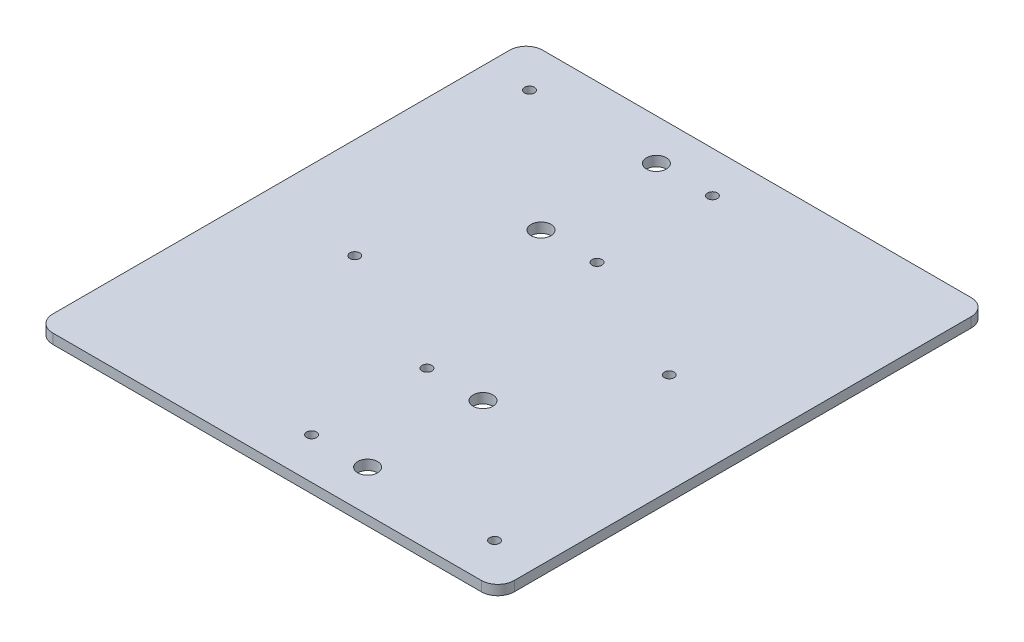
ISO-10303-21;
HEADER;
FILE_DESCRIPTION(('STEP AP214'),'2;1');
FILE_NAME('part.step','',(''),(''),'','','');
FILE_SCHEMA(('AUTOMOTIVE_DESIGN { 1 0 10303 214 1 1 1 1 }'));
ENDSEC;
DATA;
#1=APPLICATION_CONTEXT('core data for automotive mechanical design processes');
#2=APPLICATION_PROTOCOL_DEFINITION('international standard','automotive_design',2000,#1);
#3=PRODUCT_CONTEXT('',#1,'mechanical');
#4=PRODUCT('Part','Part','',(#3));
#5=PRODUCT_RELATED_PRODUCT_CATEGORY('part','',(#4));
#6=PRODUCT_DEFINITION_FORMATION('','',#4);
#7=PRODUCT_DEFINITION_CONTEXT('part definition',#1,'design');
#8=PRODUCT_DEFINITION('design','',#6,#7);
#9=PRODUCT_DEFINITION_SHAPE('','',#8);
#10=(LENGTH_UNIT() NAMED_UNIT(*) SI_UNIT(.MILLI.,.METRE.));
#11=(NAMED_UNIT(*) PLANE_ANGLE_UNIT() SI_UNIT($,.RADIAN.));
#12=(NAMED_UNIT(*) SI_UNIT($,.STERADIAN.) SOLID_ANGLE_UNIT());
#13=UNCERTAINTY_MEASURE_WITH_UNIT(LENGTH_MEASURE(1.E-05),#10,'distance_accuracy_value','');
#14=(GEOMETRIC_REPRESENTATION_CONTEXT(3) GLOBAL_UNCERTAINTY_ASSIGNED_CONTEXT((#13)) GLOBAL_UNIT_ASSIGNED_CONTEXT((#10,
#11,#12)) REPRESENTATION_CONTEXT('',''));
#15=CARTESIAN_POINT('',(0.,0.,0.));
#16=DIRECTION('',(0.,0.,1.));
#17=DIRECTION('',(1.,0.,0.));
#18=AXIS2_PLACEMENT_3D('',#15,#16,#17);
#19=CARTESIAN_POINT('',(-70.,3.,74.3));
#20=DIRECTION('',(1.,0.,0.));
#21=DIRECTION('',(0.,0.,-1.));
#22=AXIS2_PLACEMENT_3D('',#19,#20,#21);
#23=PLANE('',#22);
#24=DIRECTION('',(0.,0.,1.));
#25=VECTOR('',#24,1.);
#26=CARTESIAN_POINT('',(-70.,3.,74.3));
#27=LINE('',#26,#25);
#28=CARTESIAN_POINT('',(-70.,3.,-69.3));
#29=VERTEX_POINT('',#28);
#30=CARTESIAN_POINT('',(-70.,3.,69.3));
#31=VERTEX_POINT('',#30);
#32=EDGE_CURVE('E122',#29,#31,#27,.T.);
#33=ORIENTED_EDGE('',*,*,#32,.F.);
#34=DIRECTION('',(0.,-1.,0.));
#35=VECTOR('',#34,1.);
#36=CARTESIAN_POINT('',(-70.,3.,-69.3));
#37=LINE('',#36,#35);
#38=CARTESIAN_POINT('',(-70.,0.,-69.3));
#39=VERTEX_POINT('',#38);
#40=EDGE_CURVE('E107',#29,#39,#37,.T.);
#41=ORIENTED_EDGE('',*,*,#40,.T.);
#42=DIRECTION('',(0.,0.,1.));
#43=VECTOR('',#42,1.);
#44=CARTESIAN_POINT('',(-70.,0.,74.3));
#45=LINE('',#44,#43);
#46=CARTESIAN_POINT('',(-70.,0.,69.3));
#47=VERTEX_POINT('',#46);
#48=EDGE_CURVE('E119',#39,#47,#45,.T.);
#49=ORIENTED_EDGE('',*,*,#48,.T.);
#50=DIRECTION('',(0.,-1.,0.));
#51=VECTOR('',#50,1.);
#52=CARTESIAN_POINT('',(-70.,3.,69.3));
#53=LINE('',#52,#51);
#54=EDGE_CURVE('E124',#47,#31,#53,.F.);
#55=ORIENTED_EDGE('',*,*,#54,.T.);
#56=EDGE_LOOP('',(#33,#41,#49,#55));
#57=FACE_BOUND('',#56,.T.);
#58=ADVANCED_FACE('F37',(#57),#23,.F.);
#59=CARTESIAN_POINT('',(70.,3.,74.3));
#60=DIRECTION('',(0.,0.,-1.));
#61=DIRECTION('',(-1.,0.,0.));
#62=AXIS2_PLACEMENT_3D('',#59,#60,#61);
#63=PLANE('',#62);
#64=DIRECTION('',(1.,0.,0.));
#65=VECTOR('',#64,1.);
#66=CARTESIAN_POINT('',(70.,0.,74.3));
#67=LINE('',#66,#65);
#68=CARTESIAN_POINT('',(-65.,0.,74.3));
#69=VERTEX_POINT('',#68);
#70=CARTESIAN_POINT('',(65.,0.,74.3));
#71=VERTEX_POINT('',#70);
#72=EDGE_CURVE('E128',#69,#71,#67,.T.);
#73=ORIENTED_EDGE('',*,*,#72,.T.);
#74=DIRECTION('',(0.,-1.,0.));
#75=VECTOR('',#74,1.);
#76=CARTESIAN_POINT('',(65.,3.,74.3));
#77=LINE('',#76,#75);
#78=CARTESIAN_POINT('',(65.,3.,74.3));
#79=VERTEX_POINT('',#78);
#80=EDGE_CURVE('E11',#71,#79,#77,.F.);
#81=ORIENTED_EDGE('',*,*,#80,.T.);
#82=DIRECTION('',(1.,0.,0.));
#83=VECTOR('',#82,1.);
#84=CARTESIAN_POINT('',(70.,3.,74.3));
#85=LINE('',#84,#83);
#86=CARTESIAN_POINT('',(-65.,3.,74.3));
#87=VERTEX_POINT('',#86);
#88=EDGE_CURVE('E168',#87,#79,#85,.T.);
#89=ORIENTED_EDGE('',*,*,#88,.F.);
#90=DIRECTION('',(0.,-1.,0.));
#91=VECTOR('',#90,1.);
#92=CARTESIAN_POINT('',(-65.,3.,74.3));
#93=LINE('',#92,#91);
#94=EDGE_CURVE('E45',#87,#69,#93,.T.);
#95=ORIENTED_EDGE('',*,*,#94,.T.);
#96=EDGE_LOOP('',(#73,#81,#89,#95));
#97=FACE_BOUND('',#96,.T.);
#98=ADVANCED_FACE('F166',(#97),#63,.F.);
#99=CARTESIAN_POINT('',(70.,3.,74.3));
#100=DIRECTION('',(-1.,0.,0.));
#101=DIRECTION('',(0.,0.,1.));
#102=AXIS2_PLACEMENT_3D('',#99,#100,#101);
#103=PLANE('',#102);
#104=DIRECTION('',(0.,0.,-1.));
#105=VECTOR('',#104,1.);
#106=CARTESIAN_POINT('',(70.,0.,74.3));
#107=LINE('',#106,#105);
#108=CARTESIAN_POINT('',(70.,0.,69.3));
#109=VERTEX_POINT('',#108);
#110=CARTESIAN_POINT('',(70.,0.,-69.3));
#111=VERTEX_POINT('',#110);
#112=EDGE_CURVE('E132',#109,#111,#107,.T.);
#113=ORIENTED_EDGE('',*,*,#112,.T.);
#114=DIRECTION('',(0.,-1.,0.));
#115=VECTOR('',#114,1.);
#116=CARTESIAN_POINT('',(70.,3.,-69.3));
#117=LINE('',#116,#115);
#118=CARTESIAN_POINT('',(70.,3.,-69.3));
#119=VERTEX_POINT('',#118);
#120=EDGE_CURVE('E52',#111,#119,#117,.F.);
#121=ORIENTED_EDGE('',*,*,#120,.T.);
#122=DIRECTION('',(0.,0.,-1.));
#123=VECTOR('',#122,1.);
#124=CARTESIAN_POINT('',(70.,3.,74.3));
#125=LINE('',#124,#123);
#126=CARTESIAN_POINT('',(70.,3.,69.3));
#127=VERTEX_POINT('',#126);
#128=EDGE_CURVE('E176',#127,#119,#125,.T.);
#129=ORIENTED_EDGE('',*,*,#128,.F.);
#130=DIRECTION('',(0.,-1.,0.));
#131=VECTOR('',#130,1.);
#132=CARTESIAN_POINT('',(70.,3.,69.3));
#133=LINE('',#132,#131);
#134=EDGE_CURVE('E159',#127,#109,#133,.T.);
#135=ORIENTED_EDGE('',*,*,#134,.T.);
#136=EDGE_LOOP('',(#113,#121,#129,#135));
#137=FACE_BOUND('',#136,.T.);
#138=ADVANCED_FACE('F175',(#137),#103,.F.);
#139=CARTESIAN_POINT('',(70.,3.,-74.3));
#140=DIRECTION('',(0.,0.,1.));
#141=DIRECTION('',(1.,0.,0.));
#142=AXIS2_PLACEMENT_3D('',#139,#140,#141);
#143=PLANE('',#142);
#144=DIRECTION('',(-1.,0.,0.));
#145=VECTOR('',#144,1.);
#146=CARTESIAN_POINT('',(70.,0.,-74.3));
#147=LINE('',#146,#145);
#148=CARTESIAN_POINT('',(65.,0.,-74.3));
#149=VERTEX_POINT('',#148);
#150=CARTESIAN_POINT('',(-65.,0.,-74.3));
#151=VERTEX_POINT('',#150);
#152=EDGE_CURVE('E142',#149,#151,#147,.T.);
#153=ORIENTED_EDGE('',*,*,#152,.T.);
#154=DIRECTION('',(0.,-1.,0.));
#155=VECTOR('',#154,1.);
#156=CARTESIAN_POINT('',(-65.,3.,-74.3));
#157=LINE('',#156,#155);
#158=CARTESIAN_POINT('',(-65.,3.,-74.3));
#159=VERTEX_POINT('',#158);
#160=EDGE_CURVE('E108',#151,#159,#157,.F.);
#161=ORIENTED_EDGE('',*,*,#160,.T.);
#162=DIRECTION('',(-1.,0.,0.));
#163=VECTOR('',#162,1.);
#164=CARTESIAN_POINT('',(70.,3.,-74.3));
#165=LINE('',#164,#163);
#166=CARTESIAN_POINT('',(65.,3.,-74.3));
#167=VERTEX_POINT('',#166);
#168=EDGE_CURVE('E138',#167,#159,#165,.T.);
#169=ORIENTED_EDGE('',*,*,#168,.F.);
#170=DIRECTION('',(0.,-1.,0.));
#171=VECTOR('',#170,1.);
#172=CARTESIAN_POINT('',(65.,3.,-74.3));
#173=LINE('',#172,#171);
#174=EDGE_CURVE('E113',#167,#149,#173,.T.);
#175=ORIENTED_EDGE('',*,*,#174,.T.);
#176=EDGE_LOOP('',(#153,#161,#169,#175));
#177=FACE_BOUND('',#176,.T.);
#178=ADVANCED_FACE('F264',(#177),#143,.F.);
#179=CARTESIAN_POINT('',(0.,3.,0.));
#180=DIRECTION('',(0.,1.,0.));
#181=DIRECTION('',(0.,0.,1.));
#182=AXIS2_PLACEMENT_3D('',#179,#180,#181);
#183=PLANE('',#182);
#184=CARTESIAN_POINT('',(39.5,3.,-8.20000000000001));
#185=DIRECTION('',(0.,1.,0.));
#186=DIRECTION('',(0.,0.,-1.));
#187=AXIS2_PLACEMENT_3D('',#184,#185,#186);
#188=CIRCLE('',#187,1.5);
#189=CARTESIAN_POINT('',(39.5,3.,-9.70000000000002));
#190=VERTEX_POINT('',#189);
#191=EDGE_CURVE('E221',#190,#190,#188,.T.);
#192=ORIENTED_EDGE('',*,*,#191,.F.);
#193=EDGE_LOOP('',(#192));
#194=FACE_BOUND('',#193,.T.);
#195=CARTESIAN_POINT('',(18.,3.,61.8));
#196=DIRECTION('',(0.,1.,0.));
#197=DIRECTION('',(0.,0.,-1.));
#198=AXIS2_PLACEMENT_3D('',#195,#196,#197);
#199=CIRCLE('',#198,3.);
#200=CARTESIAN_POINT('',(18.,3.,58.8));
#201=VERTEX_POINT('',#200);
#202=EDGE_CURVE('E235',#201,#201,#199,.T.);
#203=ORIENTED_EDGE('',*,*,#202,.F.);
#204=EDGE_LOOP('',(#203));
#205=FACE_BOUND('',#204,.T.);
#206=CARTESIAN_POINT('',(1.00000000000002,3.,61.8));
#207=DIRECTION('',(0.,1.,0.));
#208=DIRECTION('',(0.,0.,-1.));
#209=AXIS2_PLACEMENT_3D('',#206,#207,#208);
#210=CIRCLE('',#209,1.5);
#211=CARTESIAN_POINT('',(1.00000000000002,3.,60.3));
#212=VERTEX_POINT('',#211);
#213=EDGE_CURVE('E228',#212,#212,#210,.T.);
#214=ORIENTED_EDGE('',*,*,#213,.F.);
#215=EDGE_LOOP('',(#214));
#216=FACE_BOUND('',#215,.T.);
#217=CARTESIAN_POINT('',(1.00000000000002,3.,26.8));
#218=DIRECTION('',(0.,1.,0.));
#219=DIRECTION('',(0.,0.,-1.));
#220=AXIS2_PLACEMENT_3D('',#217,#218,#219);
#221=CIRCLE('',#220,1.5);
#222=CARTESIAN_POINT('',(1.00000000000002,3.,25.3));
#223=VERTEX_POINT('',#222);
#224=EDGE_CURVE('E245',#223,#223,#221,.T.);
#225=ORIENTED_EDGE('',*,*,#224,.F.);
#226=EDGE_LOOP('',(#225));
#227=FACE_BOUND('',#226,.T.);
#228=CARTESIAN_POINT('',(56.5,3.,61.8));
#229=DIRECTION('',(0.,1.,0.));
#230=DIRECTION('',(0.,0.,-1.));
#231=AXIS2_PLACEMENT_3D('',#228,#229,#230);
#232=CIRCLE('',#231,1.5);
#233=CARTESIAN_POINT('',(56.5,3.,60.3));
#234=VERTEX_POINT('',#233);
#235=EDGE_CURVE('E227',#234,#234,#232,.T.);
#236=ORIENTED_EDGE('',*,*,#235,.F.);
#237=EDGE_LOOP('',(#236));
#238=FACE_BOUND('',#237,.T.);
#239=CARTESIAN_POINT('',(18.,3.,26.8));
#240=DIRECTION('',(0.,1.,0.));
#241=DIRECTION('',(0.,0.,-1.));
#242=AXIS2_PLACEMENT_3D('',#239,#240,#241);
#243=CIRCLE('',#242,3.);
#244=CARTESIAN_POINT('',(18.,3.,23.8));
#245=VERTEX_POINT('',#244);
#246=EDGE_CURVE('E215',#245,#245,#243,.T.);
#247=ORIENTED_EDGE('',*,*,#246,.F.);
#248=EDGE_LOOP('',(#247));
#249=FACE_BOUND('',#248,.T.);
#250=CARTESIAN_POINT('',(-39.5,3.,8.20000000000001));
#251=DIRECTION('',(0.,1.,0.));
#252=DIRECTION('',(0.,0.,1.));
#253=AXIS2_PLACEMENT_3D('',#250,#251,#252);
#254=CIRCLE('',#253,1.5);
#255=CARTESIAN_POINT('',(-39.5,3.,9.70000000000002));
#256=VERTEX_POINT('',#255);
#257=EDGE_CURVE('E185',#256,#256,#254,.T.);
#258=ORIENTED_EDGE('',*,*,#257,.F.);
#259=EDGE_LOOP('',(#258));
#260=FACE_BOUND('',#259,.T.);
#261=CARTESIAN_POINT('',(-18.,3.,-61.8));
#262=DIRECTION('',(0.,1.,0.));
#263=DIRECTION('',(0.,0.,1.));
#264=AXIS2_PLACEMENT_3D('',#261,#262,#263);
#265=CIRCLE('',#264,3.);
#266=CARTESIAN_POINT('',(-18.,3.,-58.8));
#267=VERTEX_POINT('',#266);
#268=EDGE_CURVE('E200',#267,#267,#265,.T.);
#269=ORIENTED_EDGE('',*,*,#268,.F.);
#270=EDGE_LOOP('',(#269));
#271=FACE_BOUND('',#270,.T.);
#272=CARTESIAN_POINT('',(-1.00000000000002,3.,-61.8));
#273=DIRECTION('',(0.,1.,0.));
#274=DIRECTION('',(0.,0.,1.));
#275=AXIS2_PLACEMENT_3D('',#272,#273,#274);
#276=CIRCLE('',#275,1.5);
#277=CARTESIAN_POINT('',(-1.00000000000002,3.,-60.3));
#278=VERTEX_POINT('',#277);
#279=EDGE_CURVE('E193',#278,#278,#276,.T.);
#280=ORIENTED_EDGE('',*,*,#279,.F.);
#281=EDGE_LOOP('',(#280));
#282=FACE_BOUND('',#281,.T.);
#283=CARTESIAN_POINT('',(-1.00000000000002,3.,-26.8));
#284=DIRECTION('',(0.,1.,0.));
#285=DIRECTION('',(0.,0.,1.));
#286=AXIS2_PLACEMENT_3D('',#283,#284,#285);
#287=CIRCLE('',#286,1.5);
#288=CARTESIAN_POINT('',(-1.00000000000002,3.,-25.3));
#289=VERTEX_POINT('',#288);
#290=EDGE_CURVE('E210',#289,#289,#287,.T.);
#291=ORIENTED_EDGE('',*,*,#290,.F.);
#292=EDGE_LOOP('',(#291));
#293=FACE_BOUND('',#292,.T.);
#294=CARTESIAN_POINT('',(-56.5,3.,-61.8));
#295=DIRECTION('',(0.,1.,0.));
#296=DIRECTION('',(0.,0.,1.));
#297=AXIS2_PLACEMENT_3D('',#294,#295,#296);
#298=CIRCLE('',#297,1.5);
#299=CARTESIAN_POINT('',(-56.5,3.,-60.3));
#300=VERTEX_POINT('',#299);
#301=EDGE_CURVE('E192',#300,#300,#298,.T.);
#302=ORIENTED_EDGE('',*,*,#301,.F.);
#303=EDGE_LOOP('',(#302));
#304=FACE_BOUND('',#303,.T.);
#305=CARTESIAN_POINT('',(-18.,3.,-26.8));
#306=DIRECTION('',(0.,1.,0.));
#307=DIRECTION('',(0.,0.,1.));
#308=AXIS2_PLACEMENT_3D('',#305,#306,#307);
#309=CIRCLE('',#308,3.);
#310=CARTESIAN_POINT('',(-18.,3.,-23.8));
#311=VERTEX_POINT('',#310);
#312=EDGE_CURVE('E135',#311,#311,#309,.T.);
#313=ORIENTED_EDGE('',*,*,#312,.F.);
#314=EDGE_LOOP('',(#313));
#315=FACE_BOUND('',#314,.T.);
#316=ORIENTED_EDGE('',*,*,#168,.T.);
#317=CARTESIAN_POINT('',(-65.,3.,-69.3));
#318=DIRECTION('',(0.,1.,0.));
#319=DIRECTION('',(0.,0.,1.));
#320=AXIS2_PLACEMENT_3D('',#317,#318,#319);
#321=CIRCLE('',#320,5.);
#322=EDGE_CURVE('E157',#159,#29,#321,.T.);
#323=ORIENTED_EDGE('',*,*,#322,.T.);
#324=ORIENTED_EDGE('',*,*,#32,.T.);
#325=CARTESIAN_POINT('',(-65.,3.,69.3));
#326=DIRECTION('',(0.,1.,0.));
#327=DIRECTION('',(0.,0.,1.));
#328=AXIS2_PLACEMENT_3D('',#325,#326,#327);
#329=CIRCLE('',#328,5.);
#330=EDGE_CURVE('E152',#31,#87,#329,.T.);
#331=ORIENTED_EDGE('',*,*,#330,.T.);
#332=ORIENTED_EDGE('',*,*,#88,.T.);
#333=CARTESIAN_POINT('',(65.,3.,69.3));
#334=DIRECTION('',(0.,1.,0.));
#335=DIRECTION('',(0.,0.,1.));
#336=AXIS2_PLACEMENT_3D('',#333,#334,#335);
#337=CIRCLE('',#336,5.);
#338=EDGE_CURVE('E59',#79,#127,#337,.T.);
#339=ORIENTED_EDGE('',*,*,#338,.T.);
#340=ORIENTED_EDGE('',*,*,#128,.T.);
#341=CARTESIAN_POINT('',(65.,3.,-69.3));
#342=DIRECTION('',(0.,1.,0.));
#343=DIRECTION('',(0.,0.,1.));
#344=AXIS2_PLACEMENT_3D('',#341,#342,#343);
#345=CIRCLE('',#344,5.);
#346=EDGE_CURVE('E155',#119,#167,#345,.T.);
#347=ORIENTED_EDGE('',*,*,#346,.T.);
#348=EDGE_LOOP('',(#316,#323,#324,#331,#332,#339,#340,#347));
#349=FACE_BOUND('',#348,.T.);
#350=ADVANCED_FACE('F261',(#194,#205,#216,#227,#238,#249,#260,#271,#282,#293,#304,#315,#349),
#183,.T.);
#351=CARTESIAN_POINT('',(0.,0.,0.));
#352=DIRECTION('',(0.,1.,0.));
#353=DIRECTION('',(0.,0.,1.));
#354=AXIS2_PLACEMENT_3D('',#351,#352,#353);
#355=PLANE('',#354);
#356=CARTESIAN_POINT('',(39.5,0.,-8.20000000000001));
#357=DIRECTION('',(0.,1.,0.));
#358=DIRECTION('',(0.,0.,-1.));
#359=AXIS2_PLACEMENT_3D('',#356,#357,#358);
#360=CIRCLE('',#359,1.5);
#361=CARTESIAN_POINT('',(39.5,0.,-9.70000000000002));
#362=VERTEX_POINT('',#361);
#363=EDGE_CURVE('E224',#362,#362,#360,.T.);
#364=ORIENTED_EDGE('',*,*,#363,.T.);
#365=EDGE_LOOP('',(#364));
#366=FACE_BOUND('',#365,.T.);
#367=CARTESIAN_POINT('',(18.,0.,61.8));
#368=DIRECTION('',(0.,1.,0.));
#369=DIRECTION('',(0.,0.,-1.));
#370=AXIS2_PLACEMENT_3D('',#367,#368,#369);
#371=CIRCLE('',#370,3.);
#372=CARTESIAN_POINT('',(18.,0.,58.8));
#373=VERTEX_POINT('',#372);
#374=EDGE_CURVE('E218',#373,#373,#371,.T.);
#375=ORIENTED_EDGE('',*,*,#374,.T.);
#376=EDGE_LOOP('',(#375));
#377=FACE_BOUND('',#376,.T.);
#378=CARTESIAN_POINT('',(1.00000000000002,0.,61.8));
#379=DIRECTION('',(0.,1.,0.));
#380=DIRECTION('',(0.,0.,-1.));
#381=AXIS2_PLACEMENT_3D('',#378,#379,#380);
#382=CIRCLE('',#381,1.5);
#383=CARTESIAN_POINT('',(1.00000000000002,0.,60.3));
#384=VERTEX_POINT('',#383);
#385=EDGE_CURVE('E231',#384,#384,#382,.T.);
#386=ORIENTED_EDGE('',*,*,#385,.T.);
#387=EDGE_LOOP('',(#386));
#388=FACE_BOUND('',#387,.T.);
#389=CARTESIAN_POINT('',(1.00000000000002,0.,26.8));
#390=DIRECTION('',(0.,1.,0.));
#391=DIRECTION('',(0.,0.,-1.));
#392=AXIS2_PLACEMENT_3D('',#389,#390,#391);
#393=CIRCLE('',#392,1.5);
#394=CARTESIAN_POINT('',(1.00000000000002,0.,25.3));
#395=VERTEX_POINT('',#394);
#396=EDGE_CURVE('E232',#395,#395,#393,.T.);
#397=ORIENTED_EDGE('',*,*,#396,.T.);
#398=EDGE_LOOP('',(#397));
#399=FACE_BOUND('',#398,.T.);
#400=CARTESIAN_POINT('',(56.5,0.,61.8));
#401=DIRECTION('',(0.,1.,0.));
#402=DIRECTION('',(0.,0.,-1.));
#403=AXIS2_PLACEMENT_3D('',#400,#401,#402);
#404=CIRCLE('',#403,1.5);
#405=CARTESIAN_POINT('',(56.5,0.,60.3));
#406=VERTEX_POINT('',#405);
#407=EDGE_CURVE('E242',#406,#406,#404,.T.);
#408=ORIENTED_EDGE('',*,*,#407,.T.);
#409=EDGE_LOOP('',(#408));
#410=FACE_BOUND('',#409,.T.);
#411=CARTESIAN_POINT('',(18.,0.,26.8));
#412=DIRECTION('',(0.,1.,0.));
#413=DIRECTION('',(0.,0.,-1.));
#414=AXIS2_PLACEMENT_3D('',#411,#412,#413);
#415=CIRCLE('',#414,3.);
#416=CARTESIAN_POINT('',(18.,0.,23.8));
#417=VERTEX_POINT('',#416);
#418=EDGE_CURVE('E189',#417,#417,#415,.T.);
#419=ORIENTED_EDGE('',*,*,#418,.T.);
#420=EDGE_LOOP('',(#419));
#421=FACE_BOUND('',#420,.T.);
#422=CARTESIAN_POINT('',(-39.5,0.,8.20000000000001));
#423=DIRECTION('',(0.,1.,0.));
#424=DIRECTION('',(0.,0.,1.));
#425=AXIS2_PLACEMENT_3D('',#422,#423,#424);
#426=CIRCLE('',#425,1.5);
#427=CARTESIAN_POINT('',(-39.5,0.,9.70000000000002));
#428=VERTEX_POINT('',#427);
#429=EDGE_CURVE('E188',#428,#428,#426,.T.);
#430=ORIENTED_EDGE('',*,*,#429,.T.);
#431=EDGE_LOOP('',(#430));
#432=FACE_BOUND('',#431,.T.);
#433=CARTESIAN_POINT('',(-18.,0.,-61.8));
#434=DIRECTION('',(0.,1.,0.));
#435=DIRECTION('',(0.,0.,1.));
#436=AXIS2_PLACEMENT_3D('',#433,#434,#435);
#437=CIRCLE('',#436,3.);
#438=CARTESIAN_POINT('',(-18.,0.,-58.8));
#439=VERTEX_POINT('',#438);
#440=EDGE_CURVE('E183',#439,#439,#437,.T.);
#441=ORIENTED_EDGE('',*,*,#440,.T.);
#442=EDGE_LOOP('',(#441));
#443=FACE_BOUND('',#442,.T.);
#444=CARTESIAN_POINT('',(-1.00000000000002,0.,-61.8));
#445=DIRECTION('',(0.,1.,0.));
#446=DIRECTION('',(0.,0.,1.));
#447=AXIS2_PLACEMENT_3D('',#444,#445,#446);
#448=CIRCLE('',#447,1.5);
#449=CARTESIAN_POINT('',(-1.00000000000002,0.,-60.3));
#450=VERTEX_POINT('',#449);
#451=EDGE_CURVE('E196',#450,#450,#448,.T.);
#452=ORIENTED_EDGE('',*,*,#451,.T.);
#453=EDGE_LOOP('',(#452));
#454=FACE_BOUND('',#453,.T.);
#455=CARTESIAN_POINT('',(-1.00000000000002,0.,-26.8));
#456=DIRECTION('',(0.,1.,0.));
#457=DIRECTION('',(0.,0.,1.));
#458=AXIS2_PLACEMENT_3D('',#455,#456,#457);
#459=CIRCLE('',#458,1.5);
#460=CARTESIAN_POINT('',(-1.00000000000002,0.,-25.3));
#461=VERTEX_POINT('',#460);
#462=EDGE_CURVE('E197',#461,#461,#459,.T.);
#463=ORIENTED_EDGE('',*,*,#462,.T.);
#464=EDGE_LOOP('',(#463));
#465=FACE_BOUND('',#464,.T.);
#466=CARTESIAN_POINT('',(-56.5,0.,-61.8));
#467=DIRECTION('',(0.,1.,0.));
#468=DIRECTION('',(0.,0.,1.));
#469=AXIS2_PLACEMENT_3D('',#466,#467,#468);
#470=CIRCLE('',#469,1.5);
#471=CARTESIAN_POINT('',(-56.5,0.,-60.3));
#472=VERTEX_POINT('',#471);
#473=EDGE_CURVE('E207',#472,#472,#470,.T.);
#474=ORIENTED_EDGE('',*,*,#473,.T.);
#475=EDGE_LOOP('',(#474));
#476=FACE_BOUND('',#475,.T.);
#477=CARTESIAN_POINT('',(-18.,0.,-26.8));
#478=DIRECTION('',(0.,1.,0.));
#479=DIRECTION('',(0.,0.,1.));
#480=AXIS2_PLACEMENT_3D('',#477,#478,#479);
#481=CIRCLE('',#480,3.);
#482=CARTESIAN_POINT('',(-18.,0.,-23.8));
#483=VERTEX_POINT('',#482);
#484=EDGE_CURVE('E129',#483,#483,#481,.T.);
#485=ORIENTED_EDGE('',*,*,#484,.T.);
#486=EDGE_LOOP('',(#485));
#487=FACE_BOUND('',#486,.T.);
#488=ORIENTED_EDGE('',*,*,#48,.F.);
#489=CARTESIAN_POINT('',(-65.,0.,-69.3));
#490=DIRECTION('',(0.,1.,0.));
#491=DIRECTION('',(0.,0.,1.));
#492=AXIS2_PLACEMENT_3D('',#489,#490,#491);
#493=CIRCLE('',#492,5.);
#494=EDGE_CURVE('E103',#39,#151,#493,.F.);
#495=ORIENTED_EDGE('',*,*,#494,.T.);
#496=ORIENTED_EDGE('',*,*,#152,.F.);
#497=CARTESIAN_POINT('',(65.,0.,-69.3));
#498=DIRECTION('',(0.,1.,0.));
#499=DIRECTION('',(0.,0.,1.));
#500=AXIS2_PLACEMENT_3D('',#497,#498,#499);
#501=CIRCLE('',#500,5.);
#502=EDGE_CURVE('E114',#149,#111,#501,.F.);
#503=ORIENTED_EDGE('',*,*,#502,.T.);
#504=ORIENTED_EDGE('',*,*,#112,.F.);
#505=CARTESIAN_POINT('',(65.,0.,69.3));
#506=DIRECTION('',(0.,1.,0.));
#507=DIRECTION('',(0.,0.,1.));
#508=AXIS2_PLACEMENT_3D('',#505,#506,#507);
#509=CIRCLE('',#508,5.);
#510=EDGE_CURVE('E146',#109,#71,#509,.F.);
#511=ORIENTED_EDGE('',*,*,#510,.T.);
#512=ORIENTED_EDGE('',*,*,#72,.F.);
#513=CARTESIAN_POINT('',(-65.,0.,69.3));
#514=DIRECTION('',(0.,1.,0.));
#515=DIRECTION('',(0.,0.,1.));
#516=AXIS2_PLACEMENT_3D('',#513,#514,#515);
#517=CIRCLE('',#516,5.);
#518=EDGE_CURVE('E123',#69,#47,#517,.F.);
#519=ORIENTED_EDGE('',*,*,#518,.T.);
#520=EDGE_LOOP('',(#488,#495,#496,#503,#504,#511,#512,#519));
#521=FACE_BOUND('',#520,.T.);
#522=ADVANCED_FACE('F126',(#366,#377,#388,#399,#410,#421,#432,#443,#454,#465,#476,#487,#521),
#355,.F.);
#523=CARTESIAN_POINT('',(-18.,0.,-26.8));
#524=DIRECTION('',(0.,1.,0.));
#525=DIRECTION('',(0.,0.,1.));
#526=AXIS2_PLACEMENT_3D('',#523,#524,#525);
#527=CYLINDRICAL_SURFACE('',#526,3.);
#528=ORIENTED_EDGE('',*,*,#484,.F.);
#529=EDGE_LOOP('',(#528));
#530=FACE_BOUND('',#529,.T.);
#531=ORIENTED_EDGE('',*,*,#312,.T.);
#532=EDGE_LOOP('',(#531));
#533=FACE_BOUND('',#532,.T.);
#534=ADVANCED_FACE('F307',(#530,#533),#527,.F.);
#535=CARTESIAN_POINT('',(-56.5,0.,-61.8));
#536=DIRECTION('',(0.,1.,0.));
#537=DIRECTION('',(0.,0.,1.));
#538=AXIS2_PLACEMENT_3D('',#535,#536,#537);
#539=CYLINDRICAL_SURFACE('',#538,1.5);
#540=ORIENTED_EDGE('',*,*,#473,.F.);
#541=EDGE_LOOP('',(#540));
#542=FACE_BOUND('',#541,.T.);
#543=ORIENTED_EDGE('',*,*,#301,.T.);
#544=EDGE_LOOP('',(#543));
#545=FACE_BOUND('',#544,.T.);
#546=ADVANCED_FACE('F312',(#542,#545),#539,.F.);
#547=CARTESIAN_POINT('',(-1.00000000000002,0.,-26.8));
#548=DIRECTION('',(0.,1.,0.));
#549=DIRECTION('',(0.,0.,1.));
#550=AXIS2_PLACEMENT_3D('',#547,#548,#549);
#551=CYLINDRICAL_SURFACE('',#550,1.5);
#552=ORIENTED_EDGE('',*,*,#462,.F.);
#553=EDGE_LOOP('',(#552));
#554=FACE_BOUND('',#553,.T.);
#555=ORIENTED_EDGE('',*,*,#290,.T.);
#556=EDGE_LOOP('',(#555));
#557=FACE_BOUND('',#556,.T.);
#558=ADVANCED_FACE('F321',(#554,#557),#551,.F.);
#559=CARTESIAN_POINT('',(-1.00000000000002,0.,-61.8));
#560=DIRECTION('',(0.,1.,0.));
#561=DIRECTION('',(0.,0.,1.));
#562=AXIS2_PLACEMENT_3D('',#559,#560,#561);
#563=CYLINDRICAL_SURFACE('',#562,1.5);
#564=ORIENTED_EDGE('',*,*,#451,.F.);
#565=EDGE_LOOP('',(#564));
#566=FACE_BOUND('',#565,.T.);
#567=ORIENTED_EDGE('',*,*,#279,.T.);
#568=EDGE_LOOP('',(#567));
#569=FACE_BOUND('',#568,.T.);
#570=ADVANCED_FACE('F318',(#566,#569),#563,.F.);
#571=CARTESIAN_POINT('',(-18.,0.,-61.8));
#572=DIRECTION('',(0.,1.,0.));
#573=DIRECTION('',(0.,0.,1.));
#574=AXIS2_PLACEMENT_3D('',#571,#572,#573);
#575=CYLINDRICAL_SURFACE('',#574,3.);
#576=ORIENTED_EDGE('',*,*,#440,.F.);
#577=EDGE_LOOP('',(#576));
#578=FACE_BOUND('',#577,.T.);
#579=ORIENTED_EDGE('',*,*,#268,.T.);
#580=EDGE_LOOP('',(#579));
#581=FACE_BOUND('',#580,.T.);
#582=ADVANCED_FACE('F316',(#578,#581),#575,.F.);
#583=CARTESIAN_POINT('',(-39.5,0.,8.20000000000001));
#584=DIRECTION('',(0.,1.,0.));
#585=DIRECTION('',(0.,0.,1.));
#586=AXIS2_PLACEMENT_3D('',#583,#584,#585);
#587=CYLINDRICAL_SURFACE('',#586,1.5);
#588=ORIENTED_EDGE('',*,*,#429,.F.);
#589=EDGE_LOOP('',(#588));
#590=FACE_BOUND('',#589,.T.);
#591=ORIENTED_EDGE('',*,*,#257,.T.);
#592=EDGE_LOOP('',(#591));
#593=FACE_BOUND('',#592,.T.);
#594=ADVANCED_FACE('F293',(#590,#593),#587,.F.);
#595=CARTESIAN_POINT('',(-65.,3.,-69.3));
#596=DIRECTION('',(0.,-1.,0.));
#597=DIRECTION('',(0.,0.,-1.));
#598=AXIS2_PLACEMENT_3D('',#595,#596,#597);
#599=CYLINDRICAL_SURFACE('',#598,5.);
#600=ORIENTED_EDGE('',*,*,#322,.F.);
#601=ORIENTED_EDGE('',*,*,#160,.F.);
#602=ORIENTED_EDGE('',*,*,#494,.F.);
#603=ORIENTED_EDGE('',*,*,#40,.F.);
#604=EDGE_LOOP('',(#600,#601,#602,#603));
#605=FACE_BOUND('',#604,.T.);
#606=ADVANCED_FACE('F106',(#605),#599,.T.);
#607=CARTESIAN_POINT('',(65.,3.,-69.3));
#608=DIRECTION('',(0.,-1.,0.));
#609=DIRECTION('',(0.,0.,-1.));
#610=AXIS2_PLACEMENT_3D('',#607,#608,#609);
#611=CYLINDRICAL_SURFACE('',#610,5.);
#612=ORIENTED_EDGE('',*,*,#346,.F.);
#613=ORIENTED_EDGE('',*,*,#120,.F.);
#614=ORIENTED_EDGE('',*,*,#502,.F.);
#615=ORIENTED_EDGE('',*,*,#174,.F.);
#616=EDGE_LOOP('',(#612,#613,#614,#615));
#617=FACE_BOUND('',#616,.T.);
#618=ADVANCED_FACE('F286',(#617),#611,.T.);
#619=CARTESIAN_POINT('',(65.,3.,69.3));
#620=DIRECTION('',(0.,-1.,0.));
#621=DIRECTION('',(0.,0.,-1.));
#622=AXIS2_PLACEMENT_3D('',#619,#620,#621);
#623=CYLINDRICAL_SURFACE('',#622,5.);
#624=ORIENTED_EDGE('',*,*,#338,.F.);
#625=ORIENTED_EDGE('',*,*,#80,.F.);
#626=ORIENTED_EDGE('',*,*,#510,.F.);
#627=ORIENTED_EDGE('',*,*,#134,.F.);
#628=EDGE_LOOP('',(#624,#625,#626,#627));
#629=FACE_BOUND('',#628,.T.);
#630=ADVANCED_FACE('F174',(#629),#623,.T.);
#631=CARTESIAN_POINT('',(-65.,3.,69.3));
#632=DIRECTION('',(0.,-1.,0.));
#633=DIRECTION('',(0.,0.,-1.));
#634=AXIS2_PLACEMENT_3D('',#631,#632,#633);
#635=CYLINDRICAL_SURFACE('',#634,5.);
#636=ORIENTED_EDGE('',*,*,#330,.F.);
#637=ORIENTED_EDGE('',*,*,#54,.F.);
#638=ORIENTED_EDGE('',*,*,#518,.F.);
#639=ORIENTED_EDGE('',*,*,#94,.F.);
#640=EDGE_LOOP('',(#636,#637,#638,#639));
#641=FACE_BOUND('',#640,.T.);
#642=ADVANCED_FACE('F39',(#641),#635,.T.);
#643=CARTESIAN_POINT('',(18.,0.,26.8));
#644=DIRECTION('',(0.,1.,0.));
#645=DIRECTION('',(0.,0.,1.));
#646=AXIS2_PLACEMENT_3D('',#643,#644,#645);
#647=CYLINDRICAL_SURFACE('',#646,3.);
#648=ORIENTED_EDGE('',*,*,#418,.F.);
#649=EDGE_LOOP('',(#648));
#650=FACE_BOUND('',#649,.T.);
#651=ORIENTED_EDGE('',*,*,#246,.T.);
#652=EDGE_LOOP('',(#651));
#653=FACE_BOUND('',#652,.T.);
#654=ADVANCED_FACE('F332',(#650,#653),#647,.F.);
#655=CARTESIAN_POINT('',(56.5,0.,61.8));
#656=DIRECTION('',(0.,1.,0.));
#657=DIRECTION('',(0.,0.,1.));
#658=AXIS2_PLACEMENT_3D('',#655,#656,#657);
#659=CYLINDRICAL_SURFACE('',#658,1.5);
#660=ORIENTED_EDGE('',*,*,#407,.F.);
#661=EDGE_LOOP('',(#660));
#662=FACE_BOUND('',#661,.T.);
#663=ORIENTED_EDGE('',*,*,#235,.T.);
#664=EDGE_LOOP('',(#663));
#665=FACE_BOUND('',#664,.T.);
#666=ADVANCED_FACE('F257',(#662,#665),#659,.F.);
#667=CARTESIAN_POINT('',(1.00000000000002,0.,26.8));
#668=DIRECTION('',(0.,1.,0.));
#669=DIRECTION('',(0.,0.,1.));
#670=AXIS2_PLACEMENT_3D('',#667,#668,#669);
#671=CYLINDRICAL_SURFACE('',#670,1.5);
#672=ORIENTED_EDGE('',*,*,#396,.F.);
#673=EDGE_LOOP('',(#672));
#674=FACE_BOUND('',#673,.T.);
#675=ORIENTED_EDGE('',*,*,#224,.T.);
#676=EDGE_LOOP('',(#675));
#677=FACE_BOUND('',#676,.T.);
#678=ADVANCED_FACE('F253',(#674,#677),#671,.F.);
#679=CARTESIAN_POINT('',(1.00000000000002,0.,61.8));
#680=DIRECTION('',(0.,1.,0.));
#681=DIRECTION('',(0.,0.,1.));
#682=AXIS2_PLACEMENT_3D('',#679,#680,#681);
#683=CYLINDRICAL_SURFACE('',#682,1.5);
#684=ORIENTED_EDGE('',*,*,#385,.F.);
#685=EDGE_LOOP('',(#684));
#686=FACE_BOUND('',#685,.T.);
#687=ORIENTED_EDGE('',*,*,#213,.T.);
#688=EDGE_LOOP('',(#687));
#689=FACE_BOUND('',#688,.T.);
#690=ADVANCED_FACE('F256',(#686,#689),#683,.F.);
#691=CARTESIAN_POINT('',(18.,0.,61.8));
#692=DIRECTION('',(0.,1.,0.));
#693=DIRECTION('',(0.,0.,1.));
#694=AXIS2_PLACEMENT_3D('',#691,#692,#693);
#695=CYLINDRICAL_SURFACE('',#694,3.);
#696=ORIENTED_EDGE('',*,*,#374,.F.);
#697=EDGE_LOOP('',(#696));
#698=FACE_BOUND('',#697,.T.);
#699=ORIENTED_EDGE('',*,*,#202,.T.);
#700=EDGE_LOOP('',(#699));
#701=FACE_BOUND('',#700,.T.);
#702=ADVANCED_FACE('F339',(#698,#701),#695,.F.);
#703=CARTESIAN_POINT('',(39.5,0.,-8.20000000000001));
#704=DIRECTION('',(0.,1.,0.));
#705=DIRECTION('',(0.,0.,1.));
#706=AXIS2_PLACEMENT_3D('',#703,#704,#705);
#707=CYLINDRICAL_SURFACE('',#706,1.5);
#708=ORIENTED_EDGE('',*,*,#363,.F.);
#709=EDGE_LOOP('',(#708));
#710=FACE_BOUND('',#709,.T.);
#711=ORIENTED_EDGE('',*,*,#191,.T.);
#712=EDGE_LOOP('',(#711));
#713=FACE_BOUND('',#712,.T.);
#714=ADVANCED_FACE('F336',(#710,#713),#707,.F.);
#715=CLOSED_SHELL('',(#58,#98,#138,#178,#350,#522,#534,#546,#558,#570,#582,#594,#606,#618,#630,
#642,#654,#666,#678,#690,#702,#714));
#716=MANIFOLD_SOLID_BREP('B2',#715);
#717=ADVANCED_BREP_SHAPE_REPRESENTATION('',(#18,#716),#14);
#718=SHAPE_DEFINITION_REPRESENTATION(#9,#717);
ENDSEC;
END-ISO-10303-21;
